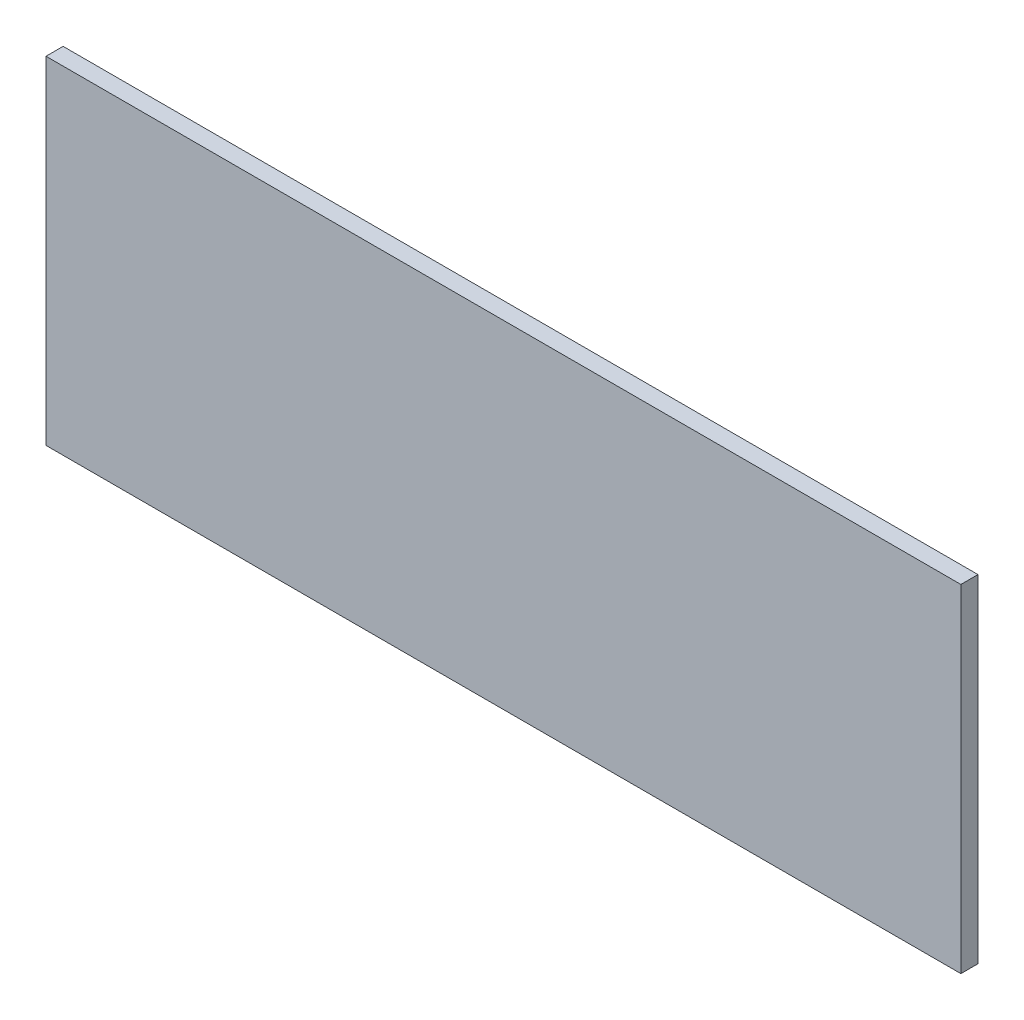
ISO-10303-21;
HEADER;
FILE_DESCRIPTION(('STEP AP214'),'2;1');
FILE_NAME('part.step','',(''),(''),'','','');
FILE_SCHEMA(('AUTOMOTIVE_DESIGN { 1 0 10303 214 1 1 1 1 }'));
ENDSEC;
DATA;
#1=APPLICATION_CONTEXT('core data for automotive mechanical design processes');
#2=APPLICATION_PROTOCOL_DEFINITION('international standard','automotive_design',2000,#1);
#3=PRODUCT_CONTEXT('',#1,'mechanical');
#4=PRODUCT('Part','Part','',(#3));
#5=PRODUCT_RELATED_PRODUCT_CATEGORY('part','',(#4));
#6=PRODUCT_DEFINITION_FORMATION('','',#4);
#7=PRODUCT_DEFINITION_CONTEXT('part definition',#1,'design');
#8=PRODUCT_DEFINITION('design','',#6,#7);
#9=PRODUCT_DEFINITION_SHAPE('','',#8);
#10=(LENGTH_UNIT() NAMED_UNIT(*) SI_UNIT(.MILLI.,.METRE.));
#11=(NAMED_UNIT(*) PLANE_ANGLE_UNIT() SI_UNIT($,.RADIAN.));
#12=(NAMED_UNIT(*) SI_UNIT($,.STERADIAN.) SOLID_ANGLE_UNIT());
#13=UNCERTAINTY_MEASURE_WITH_UNIT(LENGTH_MEASURE(1.E-05),#10,'distance_accuracy_value','');
#14=(GEOMETRIC_REPRESENTATION_CONTEXT(3) GLOBAL_UNCERTAINTY_ASSIGNED_CONTEXT((#13)) GLOBAL_UNIT_ASSIGNED_CONTEXT((#10,
#11,#12)) REPRESENTATION_CONTEXT('',''));
#15=CARTESIAN_POINT('',(0.,0.,0.));
#16=DIRECTION('',(0.,0.,1.));
#17=DIRECTION('',(1.,0.,0.));
#18=AXIS2_PLACEMENT_3D('',#15,#16,#17);
#19=CARTESIAN_POINT('',(81.8669967651367,66.3369979858398,0.));
#20=DIRECTION('',(0.,1.,0.));
#21=DIRECTION('',(1.,0.,0.));
#22=AXIS2_PLACEMENT_3D('',#19,#20,#21);
#23=PLANE('',#22);
#24=DIRECTION('',(1.,0.,0.));
#25=VECTOR('',#24,1.);
#26=CARTESIAN_POINT('',(81.8669967651367,66.3369979858398,0.03556));
#27=LINE('',#26,#25);
#28=CARTESIAN_POINT('',(81.8669967651367,66.3369979858398,0.03556));
#29=VERTEX_POINT('',#28);
#30=CARTESIAN_POINT('',(83.7669982910156,66.3369979858398,0.03556));
#31=VERTEX_POINT('',#30);
#32=EDGE_CURVE('E11',#29,#31,#27,.T.);
#33=ORIENTED_EDGE('',*,*,#32,.F.);
#34=DIRECTION('',(0.,0.,1.));
#35=VECTOR('',#34,1.);
#36=CARTESIAN_POINT('',(81.8669967651367,66.3369979858398,0.));
#37=LINE('',#36,#35);
#38=CARTESIAN_POINT('',(81.8669967651367,66.3369979858398,0.));
#39=VERTEX_POINT('',#38);
#40=EDGE_CURVE('E24',#39,#29,#37,.T.);
#41=ORIENTED_EDGE('',*,*,#40,.F.);
#42=DIRECTION('',(1.,0.,0.));
#43=VECTOR('',#42,1.);
#44=CARTESIAN_POINT('',(81.8669967651367,66.3369979858398,0.));
#45=LINE('',#44,#43);
#46=CARTESIAN_POINT('',(83.7669982910156,66.3369979858398,0.));
#47=VERTEX_POINT('',#46);
#48=EDGE_CURVE('E75',#39,#47,#45,.T.);
#49=ORIENTED_EDGE('',*,*,#48,.T.);
#50=DIRECTION('',(0.,0.,1.));
#51=VECTOR('',#50,1.);
#52=CARTESIAN_POINT('',(83.7669982910156,66.3369979858398,0.));
#53=LINE('',#52,#51);
#54=EDGE_CURVE('E37',#47,#31,#53,.T.);
#55=ORIENTED_EDGE('',*,*,#54,.T.);
#56=EDGE_LOOP('',(#33,#41,#49,#55));
#57=FACE_BOUND('',#56,.T.);
#58=ADVANCED_FACE('F17',(#57),#23,.F.);
#59=CARTESIAN_POINT('',(83.7669982910156,66.3369979858398,0.));
#60=DIRECTION('',(-1.,0.,0.));
#61=DIRECTION('',(0.,1.,0.));
#62=AXIS2_PLACEMENT_3D('',#59,#60,#61);
#63=PLANE('',#62);
#64=DIRECTION('',(0.,1.,0.));
#65=VECTOR('',#64,1.);
#66=CARTESIAN_POINT('',(83.7669982910156,66.3369979858398,0.03556));
#67=LINE('',#66,#65);
#68=CARTESIAN_POINT('',(83.7669982910156,67.0370025634766,0.03556));
#69=VERTEX_POINT('',#68);
#70=EDGE_CURVE('E83',#31,#69,#67,.T.);
#71=ORIENTED_EDGE('',*,*,#70,.F.);
#72=ORIENTED_EDGE('',*,*,#54,.F.);
#73=DIRECTION('',(0.,1.,0.));
#74=VECTOR('',#73,1.);
#75=CARTESIAN_POINT('',(83.7669982910156,66.3369979858398,0.));
#76=LINE('',#75,#74);
#77=CARTESIAN_POINT('',(83.7669982910156,67.0370025634766,0.));
#78=VERTEX_POINT('',#77);
#79=EDGE_CURVE('E81',#47,#78,#76,.T.);
#80=ORIENTED_EDGE('',*,*,#79,.T.);
#81=DIRECTION('',(0.,0.,1.));
#82=VECTOR('',#81,1.);
#83=CARTESIAN_POINT('',(83.7669982910156,67.0370025634766,0.));
#84=LINE('',#83,#82);
#85=EDGE_CURVE('E67',#78,#69,#84,.T.);
#86=ORIENTED_EDGE('',*,*,#85,.T.);
#87=EDGE_LOOP('',(#71,#72,#80,#86));
#88=FACE_BOUND('',#87,.T.);
#89=ADVANCED_FACE('F89',(#88),#63,.F.);
#90=CARTESIAN_POINT('',(83.7669982910156,67.0370025634766,0.));
#91=DIRECTION('',(0.,-1.,0.));
#92=DIRECTION('',(-1.,0.,0.));
#93=AXIS2_PLACEMENT_3D('',#90,#91,#92);
#94=PLANE('',#93);
#95=DIRECTION('',(-1.,0.,0.));
#96=VECTOR('',#95,1.);
#97=CARTESIAN_POINT('',(83.7669982910156,67.0370025634766,0.03556));
#98=LINE('',#97,#96);
#99=CARTESIAN_POINT('',(81.8669967651367,67.0370025634766,0.03556));
#100=VERTEX_POINT('',#99);
#101=EDGE_CURVE('E71',#69,#100,#98,.T.);
#102=ORIENTED_EDGE('',*,*,#101,.F.);
#103=ORIENTED_EDGE('',*,*,#85,.F.);
#104=DIRECTION('',(-1.,0.,0.));
#105=VECTOR('',#104,1.);
#106=CARTESIAN_POINT('',(83.7669982910156,67.0370025634766,0.));
#107=LINE('',#106,#105);
#108=CARTESIAN_POINT('',(81.8669967651367,67.0370025634766,0.));
#109=VERTEX_POINT('',#108);
#110=EDGE_CURVE('E63',#78,#109,#107,.T.);
#111=ORIENTED_EDGE('',*,*,#110,.T.);
#112=DIRECTION('',(0.,0.,1.));
#113=VECTOR('',#112,1.);
#114=CARTESIAN_POINT('',(81.8669967651367,67.0370025634766,0.));
#115=LINE('',#114,#113);
#116=EDGE_CURVE('E53',#109,#100,#115,.T.);
#117=ORIENTED_EDGE('',*,*,#116,.T.);
#118=EDGE_LOOP('',(#102,#103,#111,#117));
#119=FACE_BOUND('',#118,.T.);
#120=ADVANCED_FACE('F66',(#119),#94,.F.);
#121=CARTESIAN_POINT('',(81.8669967651367,67.0370025634766,0.));
#122=DIRECTION('',(1.,0.,0.));
#123=DIRECTION('',(0.,-1.,0.));
#124=AXIS2_PLACEMENT_3D('',#121,#122,#123);
#125=PLANE('',#124);
#126=DIRECTION('',(0.,-1.,0.));
#127=VECTOR('',#126,1.);
#128=CARTESIAN_POINT('',(81.8669967651367,67.0370025634766,0.03556));
#129=LINE('',#128,#127);
#130=EDGE_CURVE('E59',#100,#29,#129,.T.);
#131=ORIENTED_EDGE('',*,*,#130,.F.);
#132=ORIENTED_EDGE('',*,*,#116,.F.);
#133=DIRECTION('',(0.,-1.,0.));
#134=VECTOR('',#133,1.);
#135=CARTESIAN_POINT('',(81.8669967651367,67.0370025634766,0.));
#136=LINE('',#135,#134);
#137=EDGE_CURVE('E57',#109,#39,#136,.T.);
#138=ORIENTED_EDGE('',*,*,#137,.T.);
#139=ORIENTED_EDGE('',*,*,#40,.T.);
#140=EDGE_LOOP('',(#131,#132,#138,#139));
#141=FACE_BOUND('',#140,.T.);
#142=ADVANCED_FACE('F55',(#141),#125,.F.);
#143=CARTESIAN_POINT('',(81.8669967651367,66.3369979858398,0.));
#144=DIRECTION('',(0.,0.,-1.));
#145=DIRECTION('',(-1.,0.,0.));
#146=AXIS2_PLACEMENT_3D('',#143,#144,#145);
#147=PLANE('',#146);
#148=ORIENTED_EDGE('',*,*,#137,.F.);
#149=ORIENTED_EDGE('',*,*,#110,.F.);
#150=ORIENTED_EDGE('',*,*,#79,.F.);
#151=ORIENTED_EDGE('',*,*,#48,.F.);
#152=EDGE_LOOP('',(#148,#149,#150,#151));
#153=FACE_BOUND('',#152,.T.);
#154=ADVANCED_FACE('F74',(#153),#147,.T.);
#155=CARTESIAN_POINT('',(81.8669967651367,66.3369979858398,0.03556));
#156=DIRECTION('',(0.,0.,-1.));
#157=DIRECTION('',(-1.,0.,0.));
#158=AXIS2_PLACEMENT_3D('',#155,#156,#157);
#159=PLANE('',#158);
#160=ORIENTED_EDGE('',*,*,#32,.T.);
#161=ORIENTED_EDGE('',*,*,#70,.T.);
#162=ORIENTED_EDGE('',*,*,#101,.T.);
#163=ORIENTED_EDGE('',*,*,#130,.T.);
#164=EDGE_LOOP('',(#160,#161,#162,#163));
#165=FACE_BOUND('',#164,.T.);
#166=ADVANCED_FACE('F91',(#165),#159,.F.);
#167=CLOSED_SHELL('',(#58,#89,#120,#142,#154,#166));
#168=MANIFOLD_SOLID_BREP('B1',#167);
#169=ADVANCED_BREP_SHAPE_REPRESENTATION('',(#18,#168),#14);
#170=SHAPE_DEFINITION_REPRESENTATION(#9,#169);
ENDSEC;
END-ISO-10303-21;
